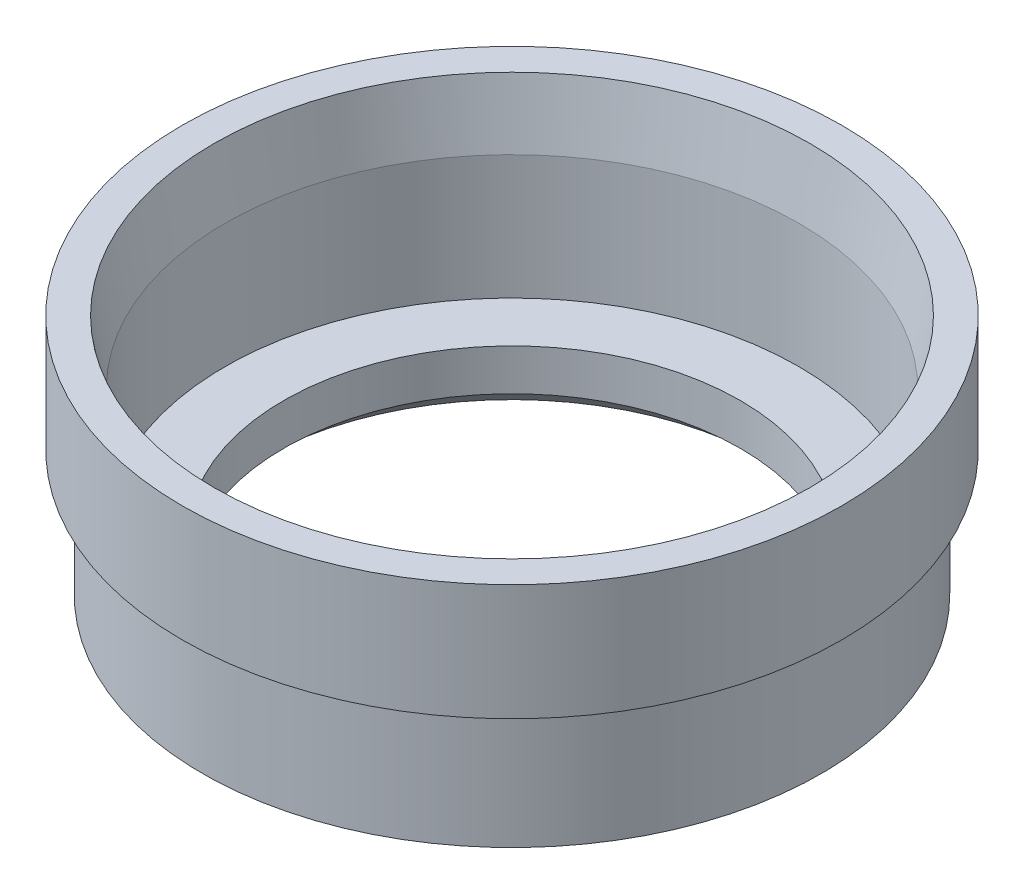
ISO-10303-21;
HEADER;
FILE_DESCRIPTION(('STEP AP214'),'2;1');
FILE_NAME('part.step','',(''),(''),'','','');
FILE_SCHEMA(('AUTOMOTIVE_DESIGN { 1 0 10303 214 1 1 1 1 }'));
ENDSEC;
DATA;
#1=APPLICATION_CONTEXT('core data for automotive mechanical design processes');
#2=APPLICATION_PROTOCOL_DEFINITION('international standard','automotive_design',2000,#1);
#3=PRODUCT_CONTEXT('',#1,'mechanical');
#4=PRODUCT('Part','Part','',(#3));
#5=PRODUCT_RELATED_PRODUCT_CATEGORY('part','',(#4));
#6=PRODUCT_DEFINITION_FORMATION('','',#4);
#7=PRODUCT_DEFINITION_CONTEXT('part definition',#1,'design');
#8=PRODUCT_DEFINITION('design','',#6,#7);
#9=PRODUCT_DEFINITION_SHAPE('','',#8);
#10=(LENGTH_UNIT() NAMED_UNIT(*) SI_UNIT(.MILLI.,.METRE.));
#11=(NAMED_UNIT(*) PLANE_ANGLE_UNIT() SI_UNIT($,.RADIAN.));
#12=(NAMED_UNIT(*) SI_UNIT($,.STERADIAN.) SOLID_ANGLE_UNIT());
#13=UNCERTAINTY_MEASURE_WITH_UNIT(LENGTH_MEASURE(1.E-05),#10,'distance_accuracy_value','');
#14=(GEOMETRIC_REPRESENTATION_CONTEXT(3) GLOBAL_UNCERTAINTY_ASSIGNED_CONTEXT((#13)) GLOBAL_UNIT_ASSIGNED_CONTEXT((#10,
#11,#12)) REPRESENTATION_CONTEXT('',''));
#15=CARTESIAN_POINT('',(0.,0.,0.));
#16=DIRECTION('',(0.,0.,1.));
#17=DIRECTION('',(1.,0.,0.));
#18=AXIS2_PLACEMENT_3D('',#15,#16,#17);
#19=CARTESIAN_POINT('',(0.,24.0144133538924,0.));
#20=DIRECTION('',(0.,-1.,0.));
#21=DIRECTION('',(0.,0.,-1.));
#22=AXIS2_PLACEMENT_3D('',#19,#20,#21);
#23=PLANE('',#22);
#24=CARTESIAN_POINT('',(-18.7,24.0144133538924,0.));
#25=DIRECTION('',(0.,-1.,0.));
#26=DIRECTION('',(0.,0.,-1.));
#27=AXIS2_PLACEMENT_3D('',#24,#25,#26);
#28=CIRCLE('',#27,27.);
#29=CARTESIAN_POINT('',(-18.7,24.0144133538924,-27.));
#30=VERTEX_POINT('',#29);
#31=EDGE_CURVE('E90',#30,#30,#28,.T.);
#32=ORIENTED_EDGE('',*,*,#31,.F.);
#33=EDGE_LOOP('',(#32));
#34=FACE_BOUND('',#33,.T.);
#35=CARTESIAN_POINT('',(-18.7,24.0144133538924,0.));
#36=DIRECTION('',(0.,-1.,0.));
#37=DIRECTION('',(0.,0.,-1.));
#38=AXIS2_PLACEMENT_3D('',#35,#36,#37);
#39=CIRCLE('',#38,24.4058882382235);
#40=CARTESIAN_POINT('',(-18.7,24.0144133538924,-24.4058882382235));
#41=VERTEX_POINT('',#40);
#42=EDGE_CURVE('E10',#41,#41,#39,.T.);
#43=ORIENTED_EDGE('',*,*,#42,.T.);
#44=EDGE_LOOP('',(#43));
#45=FACE_BOUND('',#44,.T.);
#46=ADVANCED_FACE('F39',(#34,#45),#23,.F.);
#47=CARTESIAN_POINT('',(-18.7,18.8102771556521,0.));
#48=DIRECTION('',(0.,1.,0.));
#49=DIRECTION('',(0.,0.,1.));
#50=AXIS2_PLACEMENT_3D('',#47,#48,#49);
#51=CONICAL_SURFACE('',#50,23.5,0.172343951786383);
#52=ORIENTED_EDGE('',*,*,#42,.F.);
#53=EDGE_LOOP('',(#52));
#54=FACE_BOUND('',#53,.T.);
#55=CARTESIAN_POINT('',(-18.7,18.8102771556521,0.));
#56=DIRECTION('',(0.,-1.,0.));
#57=DIRECTION('',(0.,0.,-1.));
#58=AXIS2_PLACEMENT_3D('',#55,#56,#57);
#59=CIRCLE('',#58,23.5);
#60=CARTESIAN_POINT('',(-18.7,18.8102771556521,-23.5));
#61=VERTEX_POINT('',#60);
#62=EDGE_CURVE('E46',#61,#61,#59,.T.);
#63=ORIENTED_EDGE('',*,*,#62,.T.);
#64=EDGE_LOOP('',(#63));
#65=FACE_BOUND('',#64,.T.);
#66=ADVANCED_FACE('F99',(#54,#65),#51,.F.);
#67=CARTESIAN_POINT('',(-18.7,7.43621261128227,0.));
#68=DIRECTION('',(0.,-1.,0.));
#69=DIRECTION('',(0.,0.,-1.));
#70=AXIS2_PLACEMENT_3D('',#67,#68,#69);
#71=CYLINDRICAL_SURFACE('',#70,23.5);
#72=ORIENTED_EDGE('',*,*,#62,.F.);
#73=EDGE_LOOP('',(#72));
#74=FACE_BOUND('',#73,.T.);
#75=CARTESIAN_POINT('',(-18.7,8.63946186812493,0.));
#76=DIRECTION('',(0.,-1.,0.));
#77=DIRECTION('',(0.,0.,-1.));
#78=AXIS2_PLACEMENT_3D('',#75,#76,#77);
#79=CIRCLE('',#78,23.5);
#80=CARTESIAN_POINT('',(-18.7,8.63946186812493,-23.5));
#81=VERTEX_POINT('',#80);
#82=EDGE_CURVE('E51',#81,#81,#79,.T.);
#83=ORIENTED_EDGE('',*,*,#82,.T.);
#84=EDGE_LOOP('',(#83));
#85=FACE_BOUND('',#84,.T.);
#86=ADVANCED_FACE('F103',(#74,#85),#71,.F.);
#87=CARTESIAN_POINT('',(0.,8.63946186812493,0.));
#88=DIRECTION('',(0.,-1.,0.));
#89=DIRECTION('',(0.,0.,-1.));
#90=AXIS2_PLACEMENT_3D('',#87,#88,#89);
#91=PLANE('',#90);
#92=ORIENTED_EDGE('',*,*,#82,.F.);
#93=EDGE_LOOP('',(#92));
#94=FACE_BOUND('',#93,.T.);
#95=CARTESIAN_POINT('',(-18.7,8.63946186812493,0.));
#96=DIRECTION('',(0.,-1.,0.));
#97=DIRECTION('',(0.,0.,-1.));
#98=AXIS2_PLACEMENT_3D('',#95,#96,#97);
#99=CIRCLE('',#98,18.7);
#100=CARTESIAN_POINT('',(-18.7,8.63946186812493,-18.7));
#101=VERTEX_POINT('',#100);
#102=EDGE_CURVE('E56',#101,#101,#99,.T.);
#103=ORIENTED_EDGE('',*,*,#102,.T.);
#104=EDGE_LOOP('',(#103));
#105=FACE_BOUND('',#104,.T.);
#106=ADVANCED_FACE('F108',(#94,#105),#91,.F.);
#107=CARTESIAN_POINT('',(-18.7,7.43621261128227,0.));
#108=DIRECTION('',(0.,-1.,0.));
#109=DIRECTION('',(0.,0.,-1.));
#110=AXIS2_PLACEMENT_3D('',#107,#108,#109);
#111=CYLINDRICAL_SURFACE('',#110,18.7);
#112=ORIENTED_EDGE('',*,*,#102,.F.);
#113=EDGE_LOOP('',(#112));
#114=FACE_BOUND('',#113,.T.);
#115=CARTESIAN_POINT('',(-18.7,5.24558964556921,0.));
#116=DIRECTION('',(0.,-1.,0.));
#117=DIRECTION('',(0.,0.,-1.));
#118=AXIS2_PLACEMENT_3D('',#115,#116,#117);
#119=CIRCLE('',#118,18.7);
#120=CARTESIAN_POINT('',(-18.7,5.24558964556921,-18.7));
#121=VERTEX_POINT('',#120);
#122=EDGE_CURVE('E62',#121,#121,#119,.T.);
#123=ORIENTED_EDGE('',*,*,#122,.T.);
#124=EDGE_LOOP('',(#123));
#125=FACE_BOUND('',#124,.T.);
#126=ADVANCED_FACE('F114',(#114,#125),#111,.F.);
#127=CARTESIAN_POINT('',(-18.7,3.20559711810254,0.));
#128=DIRECTION('',(0.,-1.,0.));
#129=DIRECTION('',(0.,0.,-1.));
#130=AXIS2_PLACEMENT_3D('',#127,#128,#129);
#131=CONICAL_SURFACE('',#130,20.9961701868477,0.844408917222406);
#132=ORIENTED_EDGE('',*,*,#122,.F.);
#133=EDGE_LOOP('',(#132));
#134=FACE_BOUND('',#133,.T.);
#135=CARTESIAN_POINT('',(-18.7,3.20559711810254,0.));
#136=DIRECTION('',(0.,-1.,0.));
#137=DIRECTION('',(0.,0.,-1.));
#138=AXIS2_PLACEMENT_3D('',#135,#136,#137);
#139=CIRCLE('',#138,20.9961701868477);
#140=CARTESIAN_POINT('',(-18.7,3.20559711810254,-20.9961701868477));
#141=VERTEX_POINT('',#140);
#142=EDGE_CURVE('E66',#141,#141,#139,.T.);
#143=ORIENTED_EDGE('',*,*,#142,.T.);
#144=EDGE_LOOP('',(#143));
#145=FACE_BOUND('',#144,.T.);
#146=ADVANCED_FACE('F118',(#134,#145),#131,.F.);
#147=CARTESIAN_POINT('',(0.,3.20559711810254,0.));
#148=DIRECTION('',(0.,1.,0.));
#149=DIRECTION('',(0.,0.,1.));
#150=AXIS2_PLACEMENT_3D('',#147,#148,#149);
#151=PLANE('',#150);
#152=ORIENTED_EDGE('',*,*,#142,.F.);
#153=EDGE_LOOP('',(#152));
#154=FACE_BOUND('',#153,.T.);
#155=CARTESIAN_POINT('',(-18.7,3.20559711810254,0.));
#156=DIRECTION('',(0.,-1.,0.));
#157=DIRECTION('',(0.,0.,-1.));
#158=AXIS2_PLACEMENT_3D('',#155,#156,#157);
#159=CIRCLE('',#158,22.4961701868477);
#160=CARTESIAN_POINT('',(-18.7,3.20559711810254,-22.4961701868477));
#161=VERTEX_POINT('',#160);
#162=EDGE_CURVE('E70',#161,#161,#159,.T.);
#163=ORIENTED_EDGE('',*,*,#162,.T.);
#164=EDGE_LOOP('',(#163));
#165=FACE_BOUND('',#164,.T.);
#166=ADVANCED_FACE('F122',(#154,#165),#151,.F.);
#167=CARTESIAN_POINT('',(-18.7,7.43621261128227,0.));
#168=DIRECTION('',(0.,-1.,0.));
#169=DIRECTION('',(0.,0.,-1.));
#170=AXIS2_PLACEMENT_3D('',#167,#168,#169);
#171=CYLINDRICAL_SURFACE('',#170,22.4961701868477);
#172=ORIENTED_EDGE('',*,*,#162,.F.);
#173=EDGE_LOOP('',(#172));
#174=FACE_BOUND('',#173,.T.);
#175=CARTESIAN_POINT('',(-18.7,4.20559711810254,0.));
#176=DIRECTION('',(0.,-1.,0.));
#177=DIRECTION('',(0.,0.,-1.));
#178=AXIS2_PLACEMENT_3D('',#175,#176,#177);
#179=CIRCLE('',#178,22.4961701868477);
#180=CARTESIAN_POINT('',(-18.7,4.20559711810254,-22.4961701868477));
#181=VERTEX_POINT('',#180);
#182=EDGE_CURVE('E74',#181,#181,#179,.T.);
#183=ORIENTED_EDGE('',*,*,#182,.T.);
#184=EDGE_LOOP('',(#183));
#185=FACE_BOUND('',#184,.T.);
#186=ADVANCED_FACE('F126',(#174,#185),#171,.T.);
#187=CARTESIAN_POINT('',(0.,4.20559711810254,0.));
#188=DIRECTION('',(0.,1.,0.));
#189=DIRECTION('',(0.,0.,1.));
#190=AXIS2_PLACEMENT_3D('',#187,#188,#189);
#191=PLANE('',#190);
#192=ORIENTED_EDGE('',*,*,#182,.F.);
#193=EDGE_LOOP('',(#192));
#194=FACE_BOUND('',#193,.T.);
#195=CARTESIAN_POINT('',(-18.7,4.20559711810254,0.));
#196=DIRECTION('',(0.,-1.,0.));
#197=DIRECTION('',(0.,0.,-1.));
#198=AXIS2_PLACEMENT_3D('',#195,#196,#197);
#199=CIRCLE('',#198,25.35);
#200=CARTESIAN_POINT('',(-18.7,4.20559711810254,-25.35));
#201=VERTEX_POINT('',#200);
#202=EDGE_CURVE('E78',#201,#201,#199,.T.);
#203=ORIENTED_EDGE('',*,*,#202,.T.);
#204=EDGE_LOOP('',(#203));
#205=FACE_BOUND('',#204,.T.);
#206=ADVANCED_FACE('F130',(#194,#205),#191,.F.);
#207=CARTESIAN_POINT('',(-18.7,7.43621261128227,0.));
#208=DIRECTION('',(0.,-1.,0.));
#209=DIRECTION('',(0.,0.,-1.));
#210=AXIS2_PLACEMENT_3D('',#207,#208,#209);
#211=CYLINDRICAL_SURFACE('',#210,25.35);
#212=ORIENTED_EDGE('',*,*,#202,.F.);
#213=EDGE_LOOP('',(#212));
#214=FACE_BOUND('',#213,.T.);
#215=CARTESIAN_POINT('',(-18.7,14.5055971181025,0.));
#216=DIRECTION('',(0.,-1.,0.));
#217=DIRECTION('',(0.,0.,-1.));
#218=AXIS2_PLACEMENT_3D('',#215,#216,#217);
#219=CIRCLE('',#218,25.35);
#220=CARTESIAN_POINT('',(-18.7,14.5055971181025,-25.35));
#221=VERTEX_POINT('',#220);
#222=EDGE_CURVE('E82',#221,#221,#219,.T.);
#223=ORIENTED_EDGE('',*,*,#222,.T.);
#224=EDGE_LOOP('',(#223));
#225=FACE_BOUND('',#224,.T.);
#226=ADVANCED_FACE('F134',(#214,#225),#211,.T.);
#227=CARTESIAN_POINT('',(0.,14.5055971181025,0.));
#228=DIRECTION('',(0.,-1.,0.));
#229=DIRECTION('',(0.,0.,-1.));
#230=AXIS2_PLACEMENT_3D('',#227,#228,#229);
#231=PLANE('',#230);
#232=CARTESIAN_POINT('',(-18.7,14.5055971181025,0.));
#233=DIRECTION('',(0.,-1.,0.));
#234=DIRECTION('',(0.,0.,-1.));
#235=AXIS2_PLACEMENT_3D('',#232,#233,#234);
#236=CIRCLE('',#235,27.);
#237=CARTESIAN_POINT('',(-18.7,14.5055971181025,-27.));
#238=VERTEX_POINT('',#237);
#239=EDGE_CURVE('E86',#238,#238,#236,.T.);
#240=ORIENTED_EDGE('',*,*,#239,.T.);
#241=EDGE_LOOP('',(#240));
#242=FACE_BOUND('',#241,.T.);
#243=ORIENTED_EDGE('',*,*,#222,.F.);
#244=EDGE_LOOP('',(#243));
#245=FACE_BOUND('',#244,.T.);
#246=ADVANCED_FACE('F138',(#242,#245),#231,.T.);
#247=CARTESIAN_POINT('',(-18.7,7.43621261128227,0.));
#248=DIRECTION('',(0.,-1.,0.));
#249=DIRECTION('',(0.,0.,-1.));
#250=AXIS2_PLACEMENT_3D('',#247,#248,#249);
#251=CYLINDRICAL_SURFACE('',#250,27.);
#252=ORIENTED_EDGE('',*,*,#31,.T.);
#253=EDGE_LOOP('',(#252));
#254=FACE_BOUND('',#253,.T.);
#255=ORIENTED_EDGE('',*,*,#239,.F.);
#256=EDGE_LOOP('',(#255));
#257=FACE_BOUND('',#256,.T.);
#258=ADVANCED_FACE('F95',(#254,#257),#251,.T.);
#259=CLOSED_SHELL('',(#46,#66,#86,#106,#126,#146,#166,#186,#206,#226,#246,#258));
#260=MANIFOLD_SOLID_BREP('B2',#259);
#261=ADVANCED_BREP_SHAPE_REPRESENTATION('',(#18,#260),#14);
#262=SHAPE_DEFINITION_REPRESENTATION(#9,#261);
ENDSEC;
END-ISO-10303-21;
